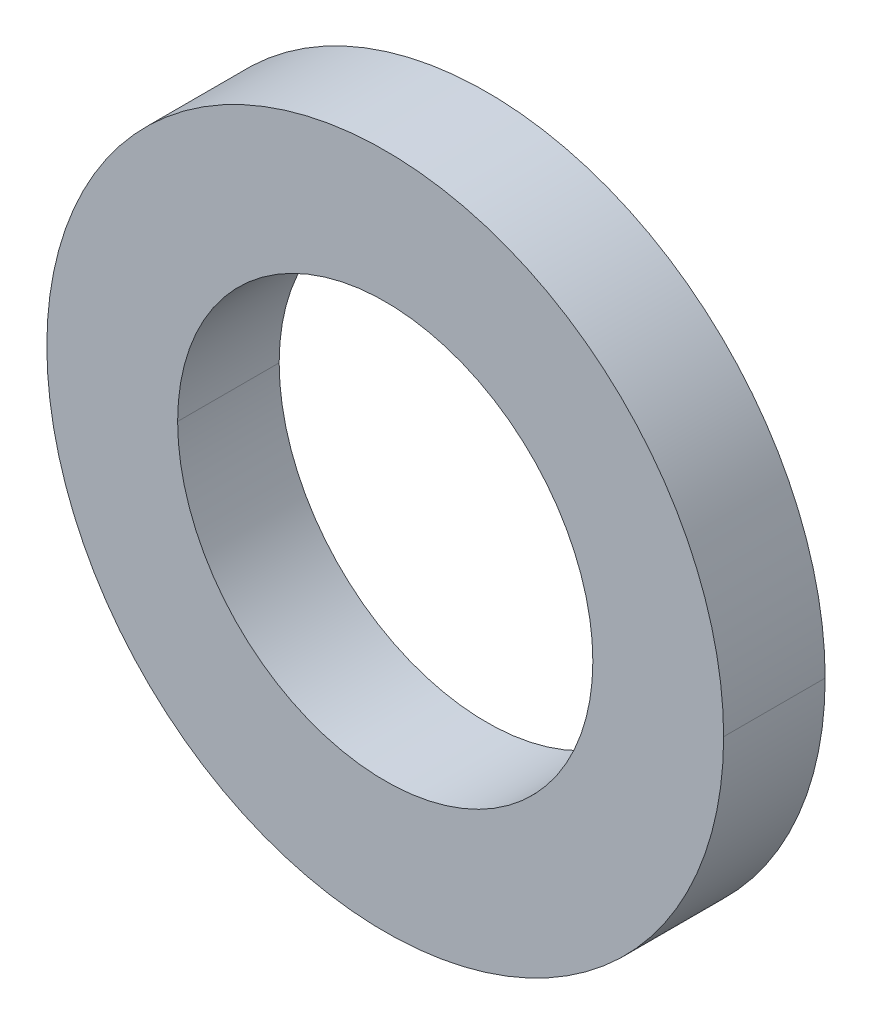
ISO-10303-21;
HEADER;
FILE_DESCRIPTION(('STEP AP214'),'2;1');
FILE_NAME('part.step','',(''),(''),'','','');
FILE_SCHEMA(('AUTOMOTIVE_DESIGN { 1 0 10303 214 1 1 1 1 }'));
ENDSEC;
DATA;
#1=APPLICATION_CONTEXT('core data for automotive mechanical design processes');
#2=APPLICATION_PROTOCOL_DEFINITION('international standard','automotive_design',2000,#1);
#3=PRODUCT_CONTEXT('',#1,'mechanical');
#4=PRODUCT('Part','Part','',(#3));
#5=PRODUCT_RELATED_PRODUCT_CATEGORY('part','',(#4));
#6=PRODUCT_DEFINITION_FORMATION('','',#4);
#7=PRODUCT_DEFINITION_CONTEXT('part definition',#1,'design');
#8=PRODUCT_DEFINITION('design','',#6,#7);
#9=PRODUCT_DEFINITION_SHAPE('','',#8);
#10=(LENGTH_UNIT() NAMED_UNIT(*) SI_UNIT(.MILLI.,.METRE.));
#11=(NAMED_UNIT(*) PLANE_ANGLE_UNIT() SI_UNIT($,.RADIAN.));
#12=(NAMED_UNIT(*) SI_UNIT($,.STERADIAN.) SOLID_ANGLE_UNIT());
#13=UNCERTAINTY_MEASURE_WITH_UNIT(LENGTH_MEASURE(1.E-05),#10,'distance_accuracy_value','');
#14=(GEOMETRIC_REPRESENTATION_CONTEXT(3) GLOBAL_UNCERTAINTY_ASSIGNED_CONTEXT((#13)) GLOBAL_UNIT_ASSIGNED_CONTEXT((#10,
#11,#12)) REPRESENTATION_CONTEXT('',''));
#15=CARTESIAN_POINT('',(0.,0.,0.));
#16=DIRECTION('',(0.,0.,1.));
#17=DIRECTION('',(1.,0.,0.));
#18=AXIS2_PLACEMENT_3D('',#15,#16,#17);
#19=CARTESIAN_POINT('',(0.,0.,-3.));
#20=DIRECTION('',(0.,0.,1.));
#21=DIRECTION('',(1.,0.,0.));
#22=AXIS2_PLACEMENT_3D('',#19,#20,#21);
#23=CYLINDRICAL_SURFACE('',#22,6.135);
#24=DIRECTION('',(0.,0.,1.));
#25=VECTOR('',#24,1.);
#26=CARTESIAN_POINT('',(-6.135,0.,-3.));
#27=LINE('',#26,#25);
#28=CARTESIAN_POINT('',(-6.135,0.,-3.));
#29=VERTEX_POINT('',#28);
#30=CARTESIAN_POINT('',(-6.135,0.,0.));
#31=VERTEX_POINT('',#30);
#32=EDGE_CURVE('E110',#29,#31,#27,.T.);
#33=ORIENTED_EDGE('',*,*,#32,.F.);
#34=CARTESIAN_POINT('',(0.,0.,-3.));
#35=DIRECTION('',(0.,0.,1.));
#36=DIRECTION('',(1.,0.,0.));
#37=AXIS2_PLACEMENT_3D('',#34,#35,#36);
#38=CIRCLE('',#37,6.135);
#39=CARTESIAN_POINT('',(6.135,0.,-3.));
#40=VERTEX_POINT('',#39);
#41=EDGE_CURVE('E41',#40,#29,#38,.T.);
#42=ORIENTED_EDGE('',*,*,#41,.F.);
#43=DIRECTION('',(0.,0.,1.));
#44=VECTOR('',#43,1.);
#45=CARTESIAN_POINT('',(6.135,0.,-3.));
#46=LINE('',#45,#44);
#47=CARTESIAN_POINT('',(6.135,0.,0.));
#48=VERTEX_POINT('',#47);
#49=EDGE_CURVE('E11',#40,#48,#46,.T.);
#50=ORIENTED_EDGE('',*,*,#49,.T.);
#51=CARTESIAN_POINT('',(0.,0.,0.));
#52=DIRECTION('',(0.,0.,1.));
#53=DIRECTION('',(1.,0.,0.));
#54=AXIS2_PLACEMENT_3D('',#51,#52,#53);
#55=CIRCLE('',#54,6.135);
#56=EDGE_CURVE('E27',#48,#31,#55,.T.);
#57=ORIENTED_EDGE('',*,*,#56,.T.);
#58=EDGE_LOOP('',(#33,#42,#50,#57));
#59=FACE_BOUND('',#58,.T.);
#60=ADVANCED_FACE('F16',(#59),#23,.F.);
#61=CARTESIAN_POINT('',(0.,0.,-3.));
#62=DIRECTION('',(0.,0.,1.));
#63=DIRECTION('',(1.,0.,0.));
#64=AXIS2_PLACEMENT_3D('',#61,#62,#63);
#65=CYLINDRICAL_SURFACE('',#64,6.135);
#66=CARTESIAN_POINT('',(0.,0.,-3.));
#67=DIRECTION('',(0.,0.,1.));
#68=DIRECTION('',(1.,0.,0.));
#69=AXIS2_PLACEMENT_3D('',#66,#67,#68);
#70=CIRCLE('',#69,6.135);
#71=EDGE_CURVE('E20',#29,#40,#70,.T.);
#72=ORIENTED_EDGE('',*,*,#71,.F.);
#73=ORIENTED_EDGE('',*,*,#32,.T.);
#74=CARTESIAN_POINT('',(0.,0.,0.));
#75=DIRECTION('',(0.,0.,1.));
#76=DIRECTION('',(1.,0.,0.));
#77=AXIS2_PLACEMENT_3D('',#74,#75,#76);
#78=CIRCLE('',#77,6.135);
#79=EDGE_CURVE('E108',#31,#48,#78,.T.);
#80=ORIENTED_EDGE('',*,*,#79,.T.);
#81=ORIENTED_EDGE('',*,*,#49,.F.);
#82=EDGE_LOOP('',(#72,#73,#80,#81));
#83=FACE_BOUND('',#82,.T.);
#84=ADVANCED_FACE('F134',(#83),#65,.F.);
#85=CARTESIAN_POINT('',(0.,0.,-3.));
#86=DIRECTION('',(0.,0.,1.));
#87=DIRECTION('',(1.,0.,0.));
#88=AXIS2_PLACEMENT_3D('',#85,#86,#87);
#89=PLANE('',#88);
#90=CARTESIAN_POINT('',(0.,0.,-3.));
#91=DIRECTION('',(0.,0.,1.));
#92=DIRECTION('',(1.,0.,0.));
#93=AXIS2_PLACEMENT_3D('',#90,#91,#92);
#94=CIRCLE('',#93,10.);
#95=CARTESIAN_POINT('',(10.,0.,-3.));
#96=VERTEX_POINT('',#95);
#97=CARTESIAN_POINT('',(-10.,0.,-3.));
#98=VERTEX_POINT('',#97);
#99=EDGE_CURVE('E66',#96,#98,#94,.T.);
#100=ORIENTED_EDGE('',*,*,#99,.F.);
#101=CARTESIAN_POINT('',(0.,0.,-3.));
#102=DIRECTION('',(0.,0.,1.));
#103=DIRECTION('',(1.,0.,0.));
#104=AXIS2_PLACEMENT_3D('',#101,#102,#103);
#105=CIRCLE('',#104,10.);
#106=EDGE_CURVE('E88',#98,#96,#105,.T.);
#107=ORIENTED_EDGE('',*,*,#106,.F.);
#108=EDGE_LOOP('',(#100,#107));
#109=FACE_BOUND('',#108,.T.);
#110=ORIENTED_EDGE('',*,*,#41,.T.);
#111=ORIENTED_EDGE('',*,*,#71,.T.);
#112=EDGE_LOOP('',(#110,#111));
#113=FACE_BOUND('',#112,.T.);
#114=ADVANCED_FACE('F144',(#109,#113),#89,.F.);
#115=CARTESIAN_POINT('',(0.,0.,0.));
#116=DIRECTION('',(0.,0.,1.));
#117=DIRECTION('',(1.,0.,0.));
#118=AXIS2_PLACEMENT_3D('',#115,#116,#117);
#119=PLANE('',#118);
#120=CARTESIAN_POINT('',(0.,0.,0.));
#121=DIRECTION('',(0.,0.,1.));
#122=DIRECTION('',(1.,0.,0.));
#123=AXIS2_PLACEMENT_3D('',#120,#121,#122);
#124=CIRCLE('',#123,10.);
#125=CARTESIAN_POINT('',(10.,0.,0.));
#126=VERTEX_POINT('',#125);
#127=CARTESIAN_POINT('',(-10.,0.,0.));
#128=VERTEX_POINT('',#127);
#129=EDGE_CURVE('E86',#126,#128,#124,.T.);
#130=ORIENTED_EDGE('',*,*,#129,.T.);
#131=CARTESIAN_POINT('',(0.,0.,0.));
#132=DIRECTION('',(0.,0.,1.));
#133=DIRECTION('',(1.,0.,0.));
#134=AXIS2_PLACEMENT_3D('',#131,#132,#133);
#135=CIRCLE('',#134,10.);
#136=EDGE_CURVE('E77',#128,#126,#135,.T.);
#137=ORIENTED_EDGE('',*,*,#136,.T.);
#138=EDGE_LOOP('',(#130,#137));
#139=FACE_BOUND('',#138,.T.);
#140=ORIENTED_EDGE('',*,*,#56,.F.);
#141=ORIENTED_EDGE('',*,*,#79,.F.);
#142=EDGE_LOOP('',(#140,#141));
#143=FACE_BOUND('',#142,.T.);
#144=ADVANCED_FACE('F84',(#139,#143),#119,.T.);
#145=CARTESIAN_POINT('',(0.,0.,-3.));
#146=DIRECTION('',(0.,0.,1.));
#147=DIRECTION('',(1.,0.,0.));
#148=AXIS2_PLACEMENT_3D('',#145,#146,#147);
#149=CYLINDRICAL_SURFACE('',#148,10.);
#150=DIRECTION('',(0.,0.,1.));
#151=VECTOR('',#150,1.);
#152=CARTESIAN_POINT('',(-10.,0.,-3.));
#153=LINE('',#152,#151);
#154=EDGE_CURVE('E91',#98,#128,#153,.T.);
#155=ORIENTED_EDGE('',*,*,#154,.F.);
#156=ORIENTED_EDGE('',*,*,#106,.T.);
#157=DIRECTION('',(0.,0.,1.));
#158=VECTOR('',#157,1.);
#159=CARTESIAN_POINT('',(10.,0.,-3.));
#160=LINE('',#159,#158);
#161=EDGE_CURVE('E90',#96,#126,#160,.T.);
#162=ORIENTED_EDGE('',*,*,#161,.T.);
#163=ORIENTED_EDGE('',*,*,#136,.F.);
#164=EDGE_LOOP('',(#155,#156,#162,#163));
#165=FACE_BOUND('',#164,.T.);
#166=ADVANCED_FACE('F95',(#165),#149,.T.);
#167=CARTESIAN_POINT('',(0.,0.,-3.));
#168=DIRECTION('',(0.,0.,1.));
#169=DIRECTION('',(1.,0.,0.));
#170=AXIS2_PLACEMENT_3D('',#167,#168,#169);
#171=CYLINDRICAL_SURFACE('',#170,10.);
#172=ORIENTED_EDGE('',*,*,#99,.T.);
#173=ORIENTED_EDGE('',*,*,#154,.T.);
#174=ORIENTED_EDGE('',*,*,#129,.F.);
#175=ORIENTED_EDGE('',*,*,#161,.F.);
#176=EDGE_LOOP('',(#172,#173,#174,#175));
#177=FACE_BOUND('',#176,.T.);
#178=ADVANCED_FACE('F18',(#177),#171,.T.);
#179=CLOSED_SHELL('',(#60,#84,#114,#144,#166,#178));
#180=MANIFOLD_SOLID_BREP('B1',#179);
#181=ADVANCED_BREP_SHAPE_REPRESENTATION('',(#18,#180),#14);
#182=SHAPE_DEFINITION_REPRESENTATION(#9,#181);
ENDSEC;
END-ISO-10303-21;
